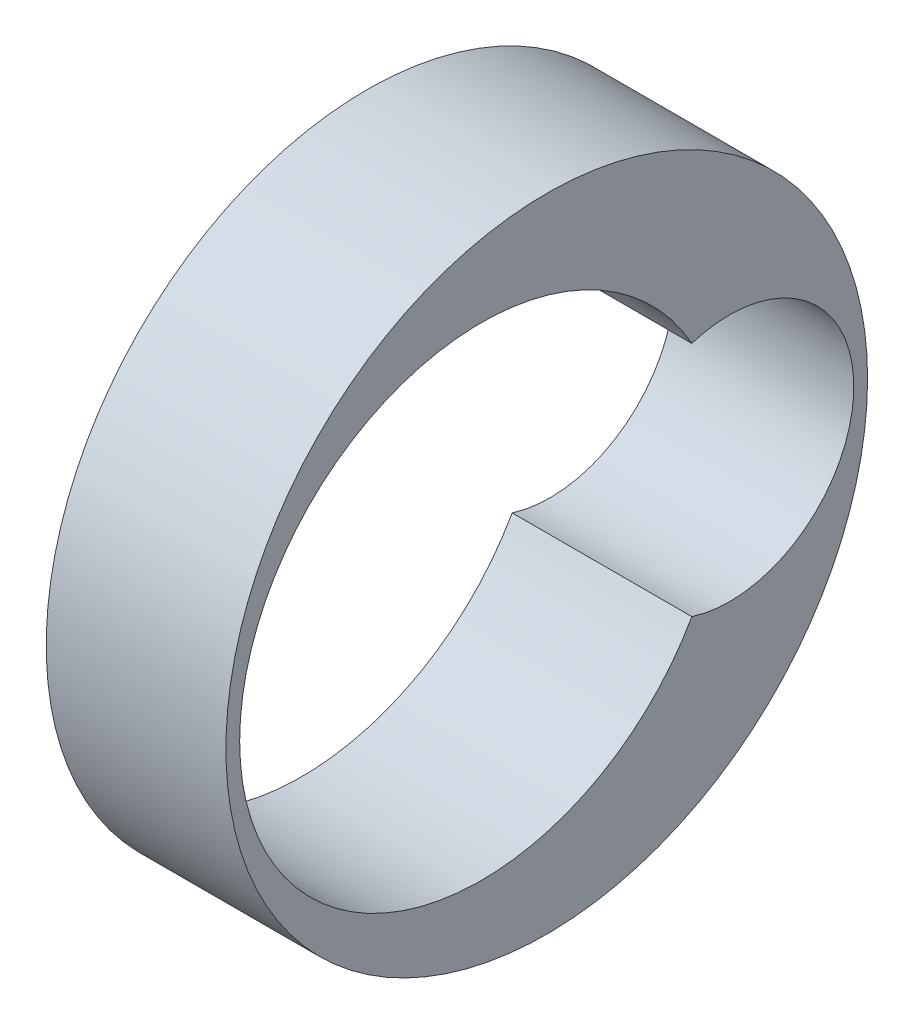
ISO-10303-21;
HEADER;
FILE_DESCRIPTION(('STEP AP214'),'2;1');
FILE_NAME('part.step','',(''),(''),'','','');
FILE_SCHEMA(('AUTOMOTIVE_DESIGN { 1 0 10303 214 1 1 1 1 }'));
ENDSEC;
DATA;
#1=APPLICATION_CONTEXT('core data for automotive mechanical design processes');
#2=APPLICATION_PROTOCOL_DEFINITION('international standard','automotive_design',2000,#1);
#3=PRODUCT_CONTEXT('',#1,'mechanical');
#4=PRODUCT('Part','Part','',(#3));
#5=PRODUCT_RELATED_PRODUCT_CATEGORY('part','',(#4));
#6=PRODUCT_DEFINITION_FORMATION('','',#4);
#7=PRODUCT_DEFINITION_CONTEXT('part definition',#1,'design');
#8=PRODUCT_DEFINITION('design','',#6,#7);
#9=PRODUCT_DEFINITION_SHAPE('','',#8);
#10=(LENGTH_UNIT() NAMED_UNIT(*) SI_UNIT(.MILLI.,.METRE.));
#11=(NAMED_UNIT(*) PLANE_ANGLE_UNIT() SI_UNIT($,.RADIAN.));
#12=(NAMED_UNIT(*) SI_UNIT($,.STERADIAN.) SOLID_ANGLE_UNIT());
#13=UNCERTAINTY_MEASURE_WITH_UNIT(LENGTH_MEASURE(1.E-05),#10,'distance_accuracy_value','');
#14=(GEOMETRIC_REPRESENTATION_CONTEXT(3) GLOBAL_UNCERTAINTY_ASSIGNED_CONTEXT((#13)) GLOBAL_UNIT_ASSIGNED_CONTEXT((#10,
#11,#12)) REPRESENTATION_CONTEXT('',''));
#15=CARTESIAN_POINT('',(0.,0.,0.));
#16=DIRECTION('',(0.,0.,1.));
#17=DIRECTION('',(1.,0.,0.));
#18=AXIS2_PLACEMENT_3D('',#15,#16,#17);
#19=CARTESIAN_POINT('',(4.34,-0.506129117835736,-16.1961317707436));
#20=DIRECTION('',(1.,0.,0.));
#21=DIRECTION('',(0.,0.,-1.));
#22=AXIS2_PLACEMENT_3D('',#19,#20,#21);
#23=PLANE('',#22);
#24=CARTESIAN_POINT('',(4.34,-0.506129117835736,-16.1961317707436));
#25=DIRECTION('',(1.,0.,0.));
#26=DIRECTION('',(0.,0.,-1.));
#27=AXIS2_PLACEMENT_3D('',#24,#25,#26);
#28=CIRCLE('',#27,7.75);
#29=CARTESIAN_POINT('',(4.34,-0.506129117835736,-23.9461317707436));
#30=VERTEX_POINT('',#29);
#31=EDGE_CURVE('E11',#30,#30,#28,.T.);
#32=ORIENTED_EDGE('',*,*,#31,.T.);
#33=EDGE_LOOP('',(#32));
#34=FACE_BOUND('',#33,.T.);
#35=CARTESIAN_POINT('',(4.34,-0.506129117835735,-14.6136317707436));
#36=DIRECTION('',(1.,0.,0.));
#37=DIRECTION('',(0.,0.,-1.));
#38=AXIS2_PLACEMENT_3D('',#35,#36,#37);
#39=CIRCLE('',#38,5.835);
#40=CARTESIAN_POINT('',(4.34,2.35165353052531,-19.7009005207436));
#41=VERTEX_POINT('',#40);
#42=CARTESIAN_POINT('',(4.34,-3.36391176619678,-19.7009005207436));
#43=VERTEX_POINT('',#42);
#44=EDGE_CURVE('E75',#41,#43,#39,.T.);
#45=ORIENTED_EDGE('',*,*,#44,.F.);
#46=CARTESIAN_POINT('',(4.34,-0.506129117835735,-20.6136317707436));
#47=DIRECTION('',(1.,0.,0.));
#48=DIRECTION('',(0.,0.,-1.));
#49=AXIS2_PLACEMENT_3D('',#46,#47,#48);
#50=CIRCLE('',#49,3.);
#51=EDGE_CURVE('E66',#43,#41,#50,.T.);
#52=ORIENTED_EDGE('',*,*,#51,.F.);
#53=EDGE_LOOP('',(#45,#52));
#54=FACE_BOUND('',#53,.T.);
#55=ADVANCED_FACE('F34',(#34,#54),#23,.T.);
#56=CARTESIAN_POINT('',(0.,-0.506129117835736,-16.1961317707436));
#57=DIRECTION('',(1.,0.,0.));
#58=DIRECTION('',(0.,0.,-1.));
#59=AXIS2_PLACEMENT_3D('',#56,#57,#58);
#60=PLANE('',#59);
#61=CARTESIAN_POINT('',(0.,-0.506129117835736,-16.1961317707436));
#62=DIRECTION('',(1.,0.,0.));
#63=DIRECTION('',(0.,0.,-1.));
#64=AXIS2_PLACEMENT_3D('',#61,#62,#63);
#65=CIRCLE('',#64,7.75);
#66=CARTESIAN_POINT('',(0.,-0.506129117835736,-23.9461317707436));
#67=VERTEX_POINT('',#66);
#68=EDGE_CURVE('E38',#67,#67,#65,.T.);
#69=ORIENTED_EDGE('',*,*,#68,.F.);
#70=EDGE_LOOP('',(#69));
#71=FACE_BOUND('',#70,.T.);
#72=CARTESIAN_POINT('',(0.,-0.506129117835735,-20.6136317707436));
#73=DIRECTION('',(1.,0.,0.));
#74=DIRECTION('',(0.,0.,-1.));
#75=AXIS2_PLACEMENT_3D('',#72,#73,#74);
#76=CIRCLE('',#75,3.);
#77=CARTESIAN_POINT('',(0.,-3.36391176619678,-19.7009005207436));
#78=VERTEX_POINT('',#77);
#79=CARTESIAN_POINT('',(0.,2.35165353052531,-19.7009005207436));
#80=VERTEX_POINT('',#79);
#81=EDGE_CURVE('E56',#78,#80,#76,.T.);
#82=ORIENTED_EDGE('',*,*,#81,.T.);
#83=CARTESIAN_POINT('',(0.,-0.506129117835735,-14.6136317707436));
#84=DIRECTION('',(1.,0.,0.));
#85=DIRECTION('',(0.,0.,-1.));
#86=AXIS2_PLACEMENT_3D('',#83,#84,#85);
#87=CIRCLE('',#86,5.835);
#88=EDGE_CURVE('E62',#80,#78,#87,.T.);
#89=ORIENTED_EDGE('',*,*,#88,.T.);
#90=EDGE_LOOP('',(#82,#89));
#91=FACE_BOUND('',#90,.T.);
#92=ADVANCED_FACE('F72',(#71,#91),#60,.F.);
#93=CARTESIAN_POINT('',(4.34,-0.506129117835736,-16.1961317707436));
#94=DIRECTION('',(-1.,0.,0.));
#95=DIRECTION('',(0.,0.,1.));
#96=AXIS2_PLACEMENT_3D('',#93,#94,#95);
#97=CYLINDRICAL_SURFACE('',#96,7.75);
#98=ORIENTED_EDGE('',*,*,#31,.F.);
#99=EDGE_LOOP('',(#98));
#100=FACE_BOUND('',#99,.T.);
#101=ORIENTED_EDGE('',*,*,#68,.T.);
#102=EDGE_LOOP('',(#101));
#103=FACE_BOUND('',#102,.T.);
#104=ADVANCED_FACE('F36',(#100,#103),#97,.T.);
#105=CARTESIAN_POINT('',(4.34,-0.506129117835735,-20.6136317707436));
#106=DIRECTION('',(-1.,0.,0.));
#107=DIRECTION('',(0.,0.,1.));
#108=AXIS2_PLACEMENT_3D('',#105,#106,#107);
#109=CYLINDRICAL_SURFACE('',#108,3.);
#110=ORIENTED_EDGE('',*,*,#81,.F.);
#111=DIRECTION('',(-1.,0.,0.));
#112=VECTOR('',#111,1.);
#113=CARTESIAN_POINT('',(4.34,-3.36391176619678,-19.7009005207436));
#114=LINE('',#113,#112);
#115=EDGE_CURVE('E64',#43,#78,#114,.T.);
#116=ORIENTED_EDGE('',*,*,#115,.F.);
#117=ORIENTED_EDGE('',*,*,#51,.T.);
#118=DIRECTION('',(-1.,0.,0.));
#119=VECTOR('',#118,1.);
#120=CARTESIAN_POINT('',(4.34,2.35165353052531,-19.7009005207436));
#121=LINE('',#120,#119);
#122=EDGE_CURVE('E49',#41,#80,#121,.T.);
#123=ORIENTED_EDGE('',*,*,#122,.T.);
#124=EDGE_LOOP('',(#110,#116,#117,#123));
#125=FACE_BOUND('',#124,.T.);
#126=ADVANCED_FACE('F68',(#125),#109,.F.);
#127=CARTESIAN_POINT('',(4.34,-0.506129117835735,-14.6136317707436));
#128=DIRECTION('',(-1.,0.,0.));
#129=DIRECTION('',(0.,0.,1.));
#130=AXIS2_PLACEMENT_3D('',#127,#128,#129);
#131=CYLINDRICAL_SURFACE('',#130,5.835);
#132=ORIENTED_EDGE('',*,*,#88,.F.);
#133=ORIENTED_EDGE('',*,*,#122,.F.);
#134=ORIENTED_EDGE('',*,*,#44,.T.);
#135=ORIENTED_EDGE('',*,*,#115,.T.);
#136=EDGE_LOOP('',(#132,#133,#134,#135));
#137=FACE_BOUND('',#136,.T.);
#138=ADVANCED_FACE('F63',(#137),#131,.F.);
#139=CLOSED_SHELL('',(#55,#92,#104,#126,#138));
#140=MANIFOLD_SOLID_BREP('B2',#139);
#141=ADVANCED_BREP_SHAPE_REPRESENTATION('',(#18,#140),#14);
#142=SHAPE_DEFINITION_REPRESENTATION(#9,#141);
ENDSEC;
END-ISO-10303-21;
